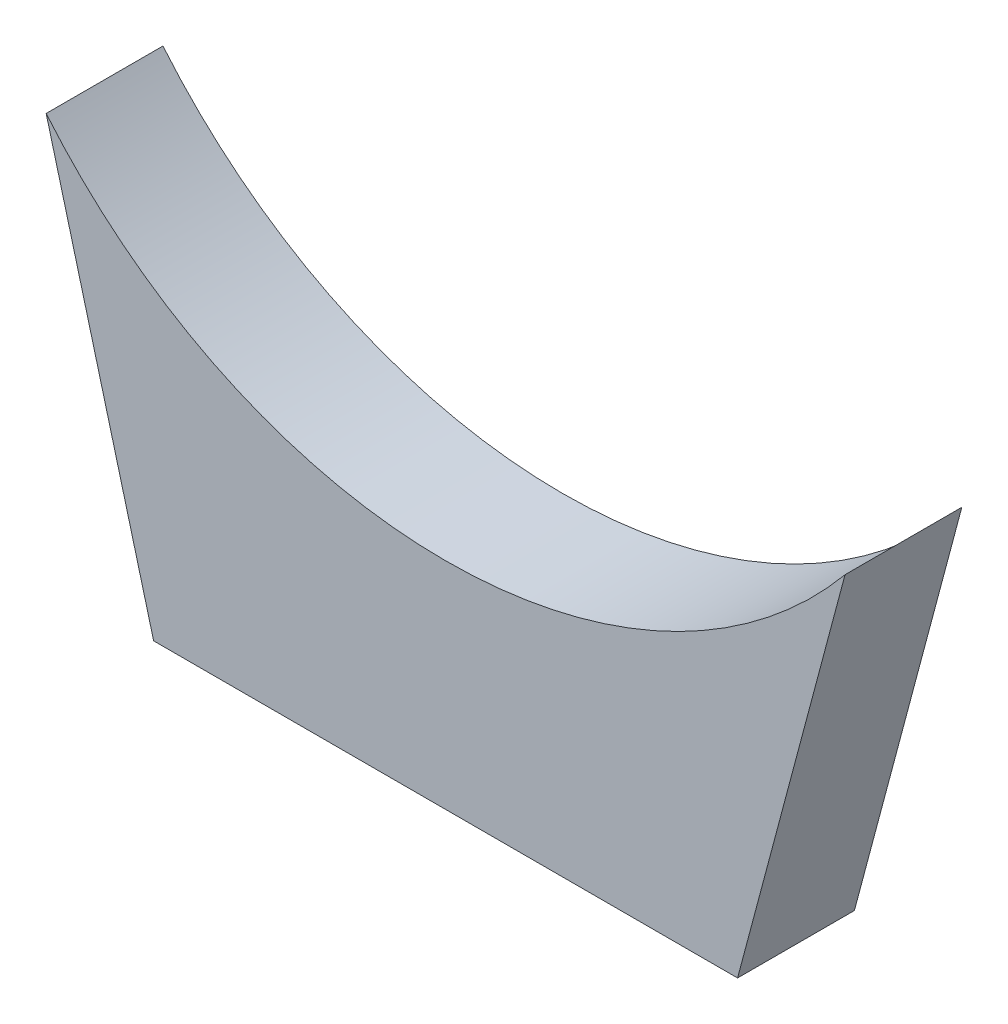
ISO-10303-21;
HEADER;
FILE_DESCRIPTION(('STEP AP214'),'2;1');
FILE_NAME('part.step','',(''),(''),'','','');
FILE_SCHEMA(('AUTOMOTIVE_DESIGN { 1 0 10303 214 1 1 1 1 }'));
ENDSEC;
DATA;
#1=APPLICATION_CONTEXT('core data for automotive mechanical design processes');
#2=APPLICATION_PROTOCOL_DEFINITION('international standard','automotive_design',2000,#1);
#3=PRODUCT_CONTEXT('',#1,'mechanical');
#4=PRODUCT('Part','Part','',(#3));
#5=PRODUCT_RELATED_PRODUCT_CATEGORY('part','',(#4));
#6=PRODUCT_DEFINITION_FORMATION('','',#4);
#7=PRODUCT_DEFINITION_CONTEXT('part definition',#1,'design');
#8=PRODUCT_DEFINITION('design','',#6,#7);
#9=PRODUCT_DEFINITION_SHAPE('','',#8);
#10=(LENGTH_UNIT() NAMED_UNIT(*) SI_UNIT(.MILLI.,.METRE.));
#11=(NAMED_UNIT(*) PLANE_ANGLE_UNIT() SI_UNIT($,.RADIAN.));
#12=(NAMED_UNIT(*) SI_UNIT($,.STERADIAN.) SOLID_ANGLE_UNIT());
#13=UNCERTAINTY_MEASURE_WITH_UNIT(LENGTH_MEASURE(1.E-05),#10,'distance_accuracy_value','');
#14=(GEOMETRIC_REPRESENTATION_CONTEXT(3) GLOBAL_UNCERTAINTY_ASSIGNED_CONTEXT((#13)) GLOBAL_UNIT_ASSIGNED_CONTEXT((#10,
#11,#12)) REPRESENTATION_CONTEXT('',''));
#15=CARTESIAN_POINT('',(0.,0.,0.));
#16=DIRECTION('',(0.,0.,1.));
#17=DIRECTION('',(1.,0.,0.));
#18=AXIS2_PLACEMENT_3D('',#15,#16,#17);
#19=CARTESIAN_POINT('',(0.,0.,211.142551715232));
#20=DIRECTION('',(0.,0.,-1.));
#21=DIRECTION('',(-1.,0.,0.));
#22=AXIS2_PLACEMENT_3D('',#19,#20,#21);
#23=PLANE('',#22);
#24=DIRECTION('',(1.,0.,0.));
#25=VECTOR('',#24,1.);
#26=CARTESIAN_POINT('',(5.52852678123751,112.063669757388,211.142551715231));
#27=LINE('',#26,#25);
#28=CARTESIAN_POINT('',(5.52852678123751,112.063669757388,211.142551715231));
#29=VERTEX_POINT('',#28);
#30=CARTESIAN_POINT('',(183.328526781238,112.063669757388,211.142551715231));
#31=VERTEX_POINT('',#30);
#32=EDGE_CURVE('E43',#29,#31,#27,.T.);
#33=ORIENTED_EDGE('',*,*,#32,.T.);
#34=DIRECTION('',(0.257662650560332,0.966234939601246,0.));
#35=VECTOR('',#34,1.);
#36=CARTESIAN_POINT('',(183.328526781238,112.063669757388,211.142551715231));
#37=LINE('',#36,#35);
#38=CARTESIAN_POINT('',(216.0516834024,234.775507086746,211.142551715231));
#39=VERTEX_POINT('',#38);
#40=EDGE_CURVE('E73',#31,#39,#37,.T.);
#41=ORIENTED_EDGE('',*,*,#40,.T.);
#42=CARTESIAN_POINT('',(94.4285267812376,335.616012130454,211.142559618111));
#43=DIRECTION('',(0.,-7.83700951832912E-08,0.999999999999997));
#44=DIRECTION('',(0.,-0.999999999999997,-7.83700951832912E-08));
#45=AXIS2_PLACEMENT_3D('',#42,#43,#44);
#46=CIRCLE('',#45,157.990505043708);
#47=CARTESIAN_POINT('',(-27.1946298399247,234.775507086747,211.142551715231));
#48=VERTEX_POINT('',#47);
#49=EDGE_CURVE('E69',#48,#39,#46,.T.);
#50=ORIENTED_EDGE('',*,*,#49,.F.);
#51=DIRECTION('',(0.257662650560332,-0.966234939601246,0.));
#52=VECTOR('',#51,1.);
#53=CARTESIAN_POINT('',(-27.1946298399247,234.775507086747,211.142551715231));
#54=LINE('',#53,#52);
#55=EDGE_CURVE('E64',#48,#29,#54,.T.);
#56=ORIENTED_EDGE('',*,*,#55,.T.);
#57=EDGE_LOOP('',(#33,#41,#50,#56));
#58=FACE_BOUND('',#57,.T.);
#59=ADVANCED_FACE('F34',(#58),#23,.F.);
#60=CARTESIAN_POINT('',(0.,0.,175.582551715232));
#61=DIRECTION('',(0.,0.,-1.));
#62=DIRECTION('',(-1.,0.,0.));
#63=AXIS2_PLACEMENT_3D('',#60,#61,#62);
#64=PLANE('',#63);
#65=DIRECTION('',(1.,0.,0.));
#66=VECTOR('',#65,1.);
#67=CARTESIAN_POINT('',(5.52852678123751,112.063669757388,175.582551715231));
#68=LINE('',#67,#66);
#69=CARTESIAN_POINT('',(5.52852678123751,112.063669757388,175.582551715231));
#70=VERTEX_POINT('',#69);
#71=CARTESIAN_POINT('',(183.328526781238,112.063669757388,175.582551715231));
#72=VERTEX_POINT('',#71);
#73=EDGE_CURVE('E12',#70,#72,#68,.T.);
#74=ORIENTED_EDGE('',*,*,#73,.F.);
#75=DIRECTION('',(0.257662650560332,-0.966234939601246,0.));
#76=VECTOR('',#75,1.);
#77=CARTESIAN_POINT('',(-27.1946298399247,234.775507086747,175.582551715231));
#78=LINE('',#77,#76);
#79=CARTESIAN_POINT('',(-27.1946298399247,234.775507086747,175.582551715231));
#80=VERTEX_POINT('',#79);
#81=EDGE_CURVE('E87',#80,#70,#78,.T.);
#82=ORIENTED_EDGE('',*,*,#81,.F.);
#83=CARTESIAN_POINT('',(94.4285267812376,335.616012130454,175.582559618111));
#84=DIRECTION('',(0.,-7.83700951832912E-08,0.999999999999997));
#85=DIRECTION('',(0.,-0.999999999999997,-7.83700951832912E-08));
#86=AXIS2_PLACEMENT_3D('',#83,#84,#85);
#87=CIRCLE('',#86,157.990505043708);
#88=CARTESIAN_POINT('',(216.0516834024,234.775507086746,175.582551715231));
#89=VERTEX_POINT('',#88);
#90=EDGE_CURVE('E80',#80,#89,#87,.T.);
#91=ORIENTED_EDGE('',*,*,#90,.T.);
#92=DIRECTION('',(0.257662650560332,0.966234939601246,0.));
#93=VECTOR('',#92,1.);
#94=CARTESIAN_POINT('',(183.328526781238,112.063669757388,175.582551715231));
#95=LINE('',#94,#93);
#96=EDGE_CURVE('E84',#72,#89,#95,.T.);
#97=ORIENTED_EDGE('',*,*,#96,.F.);
#98=EDGE_LOOP('',(#74,#82,#91,#97));
#99=FACE_BOUND('',#98,.T.);
#100=ADVANCED_FACE('F82',(#99),#64,.T.);
#101=CARTESIAN_POINT('',(-27.1946298399247,234.775507086747,175.582551715231));
#102=DIRECTION('',(-0.966234939601246,-0.257662650560332,0.));
#103=DIRECTION('',(0.257662650560332,-0.966234939601247,0.));
#104=AXIS2_PLACEMENT_3D('',#101,#102,#103);
#105=PLANE('',#104);
#106=ORIENTED_EDGE('',*,*,#55,.F.);
#107=DIRECTION('',(0.,0.,1.));
#108=VECTOR('',#107,1.);
#109=CARTESIAN_POINT('',(-27.1946298399248,234.775507086747,175.582551715231));
#110=LINE('',#109,#108);
#111=EDGE_CURVE('E106',#80,#48,#110,.T.);
#112=ORIENTED_EDGE('',*,*,#111,.F.);
#113=ORIENTED_EDGE('',*,*,#81,.T.);
#114=DIRECTION('',(0.,0.,1.));
#115=VECTOR('',#114,1.);
#116=CARTESIAN_POINT('',(5.52852678123751,112.063669757388,175.582551715231));
#117=LINE('',#116,#115);
#118=EDGE_CURVE('E119',#70,#29,#117,.T.);
#119=ORIENTED_EDGE('',*,*,#118,.T.);
#120=EDGE_LOOP('',(#106,#112,#113,#119));
#121=FACE_BOUND('',#120,.T.);
#122=ADVANCED_FACE('F130',(#121),#105,.T.);
#123=CARTESIAN_POINT('',(183.328526781238,112.063669757388,175.582551715231));
#124=DIRECTION('',(0.966234939601246,-0.257662650560332,0.));
#125=DIRECTION('',(0.257662650560332,0.966234939601246,0.));
#126=AXIS2_PLACEMENT_3D('',#123,#124,#125);
#127=PLANE('',#126);
#128=ORIENTED_EDGE('',*,*,#40,.F.);
#129=DIRECTION('',(0.,0.,1.));
#130=VECTOR('',#129,1.);
#131=CARTESIAN_POINT('',(183.328526781238,112.063669757388,175.582551715231));
#132=LINE('',#131,#130);
#133=EDGE_CURVE('E96',#72,#31,#132,.T.);
#134=ORIENTED_EDGE('',*,*,#133,.F.);
#135=ORIENTED_EDGE('',*,*,#96,.T.);
#136=DIRECTION('',(0.,0.,1.));
#137=VECTOR('',#136,1.);
#138=CARTESIAN_POINT('',(216.0516834024,234.775507086747,175.582551715231));
#139=LINE('',#138,#137);
#140=EDGE_CURVE('E90',#89,#39,#139,.T.);
#141=ORIENTED_EDGE('',*,*,#140,.T.);
#142=EDGE_LOOP('',(#128,#134,#135,#141));
#143=FACE_BOUND('',#142,.T.);
#144=ADVANCED_FACE('F95',(#143),#127,.T.);
#145=CARTESIAN_POINT('',(5.52852678123751,112.063669757388,175.582551715231));
#146=DIRECTION('',(0.,-1.,0.));
#147=DIRECTION('',(0.,0.,-1.));
#148=AXIS2_PLACEMENT_3D('',#145,#146,#147);
#149=PLANE('',#148);
#150=ORIENTED_EDGE('',*,*,#32,.F.);
#151=ORIENTED_EDGE('',*,*,#118,.F.);
#152=ORIENTED_EDGE('',*,*,#73,.T.);
#153=ORIENTED_EDGE('',*,*,#133,.T.);
#154=EDGE_LOOP('',(#150,#151,#152,#153));
#155=FACE_BOUND('',#154,.T.);
#156=ADVANCED_FACE('F132',(#155),#149,.T.);
#157=CARTESIAN_POINT('',(94.4285267812376,335.616012130454,175.582559618111));
#158=DIRECTION('',(0.,0.,1.));
#159=DIRECTION('',(1.,0.,0.));
#160=AXIS2_PLACEMENT_3D('',#157,#158,#159);
#161=CYLINDRICAL_SURFACE('',#160,157.990505043708);
#162=ORIENTED_EDGE('',*,*,#49,.T.);
#163=ORIENTED_EDGE('',*,*,#140,.F.);
#164=ORIENTED_EDGE('',*,*,#90,.F.);
#165=ORIENTED_EDGE('',*,*,#111,.T.);
#166=EDGE_LOOP('',(#162,#163,#164,#165));
#167=FACE_BOUND('',#166,.T.);
#168=ADVANCED_FACE('F92',(#167),#161,.F.);
#169=CLOSED_SHELL('',(#59,#100,#122,#144,#156,#168));
#170=MANIFOLD_SOLID_BREP('B2',#169);
#171=ADVANCED_BREP_SHAPE_REPRESENTATION('',(#18,#170),#14);
#172=SHAPE_DEFINITION_REPRESENTATION(#9,#171);
ENDSEC;
END-ISO-10303-21;
